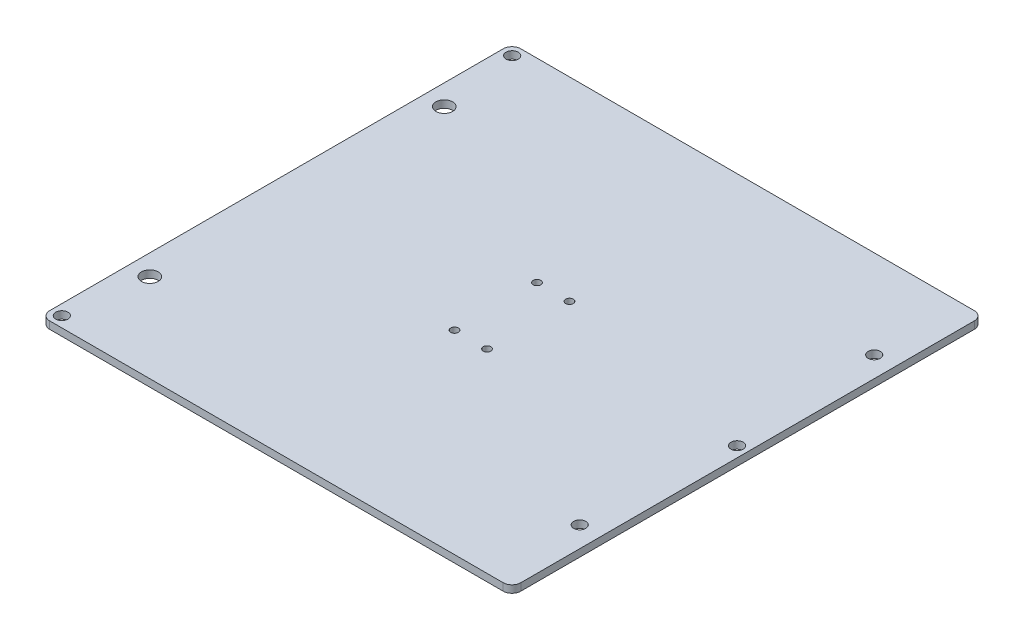
ISO-10303-21;
HEADER;
FILE_DESCRIPTION(('STEP AP214'),'2;1');
FILE_NAME('part.step','',(''),(''),'','','');
FILE_SCHEMA(('AUTOMOTIVE_DESIGN { 1 0 10303 214 1 1 1 1 }'));
ENDSEC;
DATA;
#1=APPLICATION_CONTEXT('core data for automotive mechanical design processes');
#2=APPLICATION_PROTOCOL_DEFINITION('international standard','automotive_design',2000,#1);
#3=PRODUCT_CONTEXT('',#1,'mechanical');
#4=PRODUCT('Part','Part','',(#3));
#5=PRODUCT_RELATED_PRODUCT_CATEGORY('part','',(#4));
#6=PRODUCT_DEFINITION_FORMATION('','',#4);
#7=PRODUCT_DEFINITION_CONTEXT('part definition',#1,'design');
#8=PRODUCT_DEFINITION('design','',#6,#7);
#9=PRODUCT_DEFINITION_SHAPE('','',#8);
#10=(LENGTH_UNIT() NAMED_UNIT(*) SI_UNIT(.MILLI.,.METRE.));
#11=(NAMED_UNIT(*) PLANE_ANGLE_UNIT() SI_UNIT($,.RADIAN.));
#12=(NAMED_UNIT(*) SI_UNIT($,.STERADIAN.) SOLID_ANGLE_UNIT());
#13=UNCERTAINTY_MEASURE_WITH_UNIT(LENGTH_MEASURE(1.E-05),#10,'distance_accuracy_value','');
#14=(GEOMETRIC_REPRESENTATION_CONTEXT(3) GLOBAL_UNCERTAINTY_ASSIGNED_CONTEXT((#13)) GLOBAL_UNIT_ASSIGNED_CONTEXT((#10,
#11,#12)) REPRESENTATION_CONTEXT('',''));
#15=CARTESIAN_POINT('',(0.,0.,0.));
#16=DIRECTION('',(0.,0.,1.));
#17=DIRECTION('',(1.,0.,0.));
#18=AXIS2_PLACEMENT_3D('',#15,#16,#17);
#19=CARTESIAN_POINT('',(0.,3.175,0.));
#20=DIRECTION('',(1.,0.,0.));
#21=DIRECTION('',(0.,0.,-1.));
#22=AXIS2_PLACEMENT_3D('',#19,#20,#21);
#23=PLANE('',#22);
#24=DIRECTION('',(0.,0.,1.));
#25=VECTOR('',#24,1.);
#26=CARTESIAN_POINT('',(0.,3.175,0.));
#27=LINE('',#26,#25);
#28=CARTESIAN_POINT('',(0.,3.175,-199.39));
#29=VERTEX_POINT('',#28);
#30=CARTESIAN_POINT('',(0.,3.175,-3.81));
#31=VERTEX_POINT('',#30);
#32=EDGE_CURVE('E118',#29,#31,#27,.T.);
#33=ORIENTED_EDGE('',*,*,#32,.F.);
#34=DIRECTION('',(0.,-1.,0.));
#35=VECTOR('',#34,1.);
#36=CARTESIAN_POINT('',(0.,3.175,-199.39));
#37=LINE('',#36,#35);
#38=CARTESIAN_POINT('',(0.,0.,-199.39));
#39=VERTEX_POINT('',#38);
#40=EDGE_CURVE('E103',#29,#39,#37,.T.);
#41=ORIENTED_EDGE('',*,*,#40,.T.);
#42=DIRECTION('',(0.,0.,1.));
#43=VECTOR('',#42,1.);
#44=CARTESIAN_POINT('',(0.,0.,0.));
#45=LINE('',#44,#43);
#46=CARTESIAN_POINT('',(0.,0.,-3.81));
#47=VERTEX_POINT('',#46);
#48=EDGE_CURVE('E115',#39,#47,#45,.T.);
#49=ORIENTED_EDGE('',*,*,#48,.T.);
#50=DIRECTION('',(0.,-1.,0.));
#51=VECTOR('',#50,1.);
#52=CARTESIAN_POINT('',(0.,3.175,-3.81));
#53=LINE('',#52,#51);
#54=EDGE_CURVE('E120',#47,#31,#53,.F.);
#55=ORIENTED_EDGE('',*,*,#54,.T.);
#56=EDGE_LOOP('',(#33,#41,#49,#55));
#57=FACE_BOUND('',#56,.T.);
#58=ADVANCED_FACE('F33',(#57),#23,.F.);
#59=CARTESIAN_POINT('',(0.,3.175,0.));
#60=DIRECTION('',(0.,0.,-1.));
#61=DIRECTION('',(-1.,0.,0.));
#62=AXIS2_PLACEMENT_3D('',#59,#60,#61);
#63=PLANE('',#62);
#64=DIRECTION('',(1.,0.,0.));
#65=VECTOR('',#64,1.);
#66=CARTESIAN_POINT('',(0.,0.,0.));
#67=LINE('',#66,#65);
#68=CARTESIAN_POINT('',(3.81,0.,0.));
#69=VERTEX_POINT('',#68);
#70=CARTESIAN_POINT('',(199.39,0.,0.));
#71=VERTEX_POINT('',#70);
#72=EDGE_CURVE('E124',#69,#71,#67,.T.);
#73=ORIENTED_EDGE('',*,*,#72,.T.);
#74=DIRECTION('',(0.,-1.,0.));
#75=VECTOR('',#74,1.);
#76=CARTESIAN_POINT('',(199.39,3.175,0.));
#77=LINE('',#76,#75);
#78=CARTESIAN_POINT('',(199.39,3.175,0.));
#79=VERTEX_POINT('',#78);
#80=EDGE_CURVE('E11',#71,#79,#77,.F.);
#81=ORIENTED_EDGE('',*,*,#80,.T.);
#82=DIRECTION('',(1.,0.,0.));
#83=VECTOR('',#82,1.);
#84=CARTESIAN_POINT('',(0.,3.175,0.));
#85=LINE('',#84,#83);
#86=CARTESIAN_POINT('',(3.81,3.175,0.));
#87=VERTEX_POINT('',#86);
#88=EDGE_CURVE('E164',#87,#79,#85,.T.);
#89=ORIENTED_EDGE('',*,*,#88,.F.);
#90=DIRECTION('',(0.,-1.,0.));
#91=VECTOR('',#90,1.);
#92=CARTESIAN_POINT('',(3.81,3.175,0.));
#93=LINE('',#92,#91);
#94=EDGE_CURVE('E41',#87,#69,#93,.T.);
#95=ORIENTED_EDGE('',*,*,#94,.T.);
#96=EDGE_LOOP('',(#73,#81,#89,#95));
#97=FACE_BOUND('',#96,.T.);
#98=ADVANCED_FACE('F162',(#97),#63,.F.);
#99=CARTESIAN_POINT('',(203.2,3.175,0.));
#100=DIRECTION('',(-1.,0.,0.));
#101=DIRECTION('',(0.,0.,1.));
#102=AXIS2_PLACEMENT_3D('',#99,#100,#101);
#103=PLANE('',#102);
#104=DIRECTION('',(0.,0.,-1.));
#105=VECTOR('',#104,1.);
#106=CARTESIAN_POINT('',(203.2,0.,0.));
#107=LINE('',#106,#105);
#108=CARTESIAN_POINT('',(203.2,0.,-3.81));
#109=VERTEX_POINT('',#108);
#110=CARTESIAN_POINT('',(203.2,0.,-199.39));
#111=VERTEX_POINT('',#110);
#112=EDGE_CURVE('E128',#109,#111,#107,.T.);
#113=ORIENTED_EDGE('',*,*,#112,.T.);
#114=DIRECTION('',(0.,-1.,0.));
#115=VECTOR('',#114,1.);
#116=CARTESIAN_POINT('',(203.2,3.175,-199.39));
#117=LINE('',#116,#115);
#118=CARTESIAN_POINT('',(203.2,3.175,-199.39));
#119=VERTEX_POINT('',#118);
#120=EDGE_CURVE('E48',#111,#119,#117,.F.);
#121=ORIENTED_EDGE('',*,*,#120,.T.);
#122=DIRECTION('',(0.,0.,-1.));
#123=VECTOR('',#122,1.);
#124=CARTESIAN_POINT('',(203.2,3.175,0.));
#125=LINE('',#124,#123);
#126=CARTESIAN_POINT('',(203.2,3.175,-3.81));
#127=VERTEX_POINT('',#126);
#128=EDGE_CURVE('E172',#127,#119,#125,.T.);
#129=ORIENTED_EDGE('',*,*,#128,.F.);
#130=DIRECTION('',(0.,-1.,0.));
#131=VECTOR('',#130,1.);
#132=CARTESIAN_POINT('',(203.2,3.175,-3.81));
#133=LINE('',#132,#131);
#134=EDGE_CURVE('E155',#127,#109,#133,.T.);
#135=ORIENTED_EDGE('',*,*,#134,.T.);
#136=EDGE_LOOP('',(#113,#121,#129,#135));
#137=FACE_BOUND('',#136,.T.);
#138=ADVANCED_FACE('F171',(#137),#103,.F.);
#139=CARTESIAN_POINT('',(0.,3.175,-203.2));
#140=DIRECTION('',(0.,0.,1.));
#141=DIRECTION('',(1.,0.,0.));
#142=AXIS2_PLACEMENT_3D('',#139,#140,#141);
#143=PLANE('',#142);
#144=DIRECTION('',(-1.,0.,0.));
#145=VECTOR('',#144,1.);
#146=CARTESIAN_POINT('',(0.,0.,-203.2));
#147=LINE('',#146,#145);
#148=CARTESIAN_POINT('',(199.39,0.,-203.2));
#149=VERTEX_POINT('',#148);
#150=CARTESIAN_POINT('',(3.81,0.,-203.2));
#151=VERTEX_POINT('',#150);
#152=EDGE_CURVE('E138',#149,#151,#147,.T.);
#153=ORIENTED_EDGE('',*,*,#152,.T.);
#154=DIRECTION('',(0.,-1.,0.));
#155=VECTOR('',#154,1.);
#156=CARTESIAN_POINT('',(3.81,3.175,-203.2));
#157=LINE('',#156,#155);
#158=CARTESIAN_POINT('',(3.81,3.175,-203.2));
#159=VERTEX_POINT('',#158);
#160=EDGE_CURVE('E104',#151,#159,#157,.F.);
#161=ORIENTED_EDGE('',*,*,#160,.T.);
#162=DIRECTION('',(-1.,0.,0.));
#163=VECTOR('',#162,1.);
#164=CARTESIAN_POINT('',(0.,3.175,-203.2));
#165=LINE('',#164,#163);
#166=CARTESIAN_POINT('',(199.39,3.175,-203.2));
#167=VERTEX_POINT('',#166);
#168=EDGE_CURVE('E134',#167,#159,#165,.T.);
#169=ORIENTED_EDGE('',*,*,#168,.F.);
#170=DIRECTION('',(0.,-1.,0.));
#171=VECTOR('',#170,1.);
#172=CARTESIAN_POINT('',(199.39,3.175,-203.2));
#173=LINE('',#172,#171);
#174=EDGE_CURVE('E109',#167,#149,#173,.T.);
#175=ORIENTED_EDGE('',*,*,#174,.T.);
#176=EDGE_LOOP('',(#153,#161,#169,#175));
#177=FACE_BOUND('',#176,.T.);
#178=ADVANCED_FACE('F246',(#177),#143,.F.);
#179=CARTESIAN_POINT('',(0.,3.175,0.));
#180=DIRECTION('',(0.,-1.,0.));
#181=DIRECTION('',(0.,0.,-1.));
#182=AXIS2_PLACEMENT_3D('',#179,#180,#181);
#183=PLANE('',#182);
#184=CARTESIAN_POINT('',(94.6,3.175,-83.82));
#185=DIRECTION('',(0.,1.,0.));
#186=DIRECTION('',(0.,0.,-1.));
#187=AXIS2_PLACEMENT_3D('',#184,#185,#186);
#188=CIRCLE('',#187,1.65);
#189=CARTESIAN_POINT('',(94.6,3.175,-85.47));
#190=VERTEX_POINT('',#189);
#191=EDGE_CURVE('E232',#190,#190,#188,.T.);
#192=ORIENTED_EDGE('',*,*,#191,.F.);
#193=EDGE_LOOP('',(#192));
#194=FACE_BOUND('',#193,.T.);
#195=CARTESIAN_POINT('',(108.6,3.175,-83.82));
#196=DIRECTION('',(0.,1.,0.));
#197=DIRECTION('',(0.,0.,-1.));
#198=AXIS2_PLACEMENT_3D('',#195,#196,#197);
#199=CIRCLE('',#198,1.65);
#200=CARTESIAN_POINT('',(108.6,3.175,-85.47));
#201=VERTEX_POINT('',#200);
#202=EDGE_CURVE('E226',#201,#201,#199,.T.);
#203=ORIENTED_EDGE('',*,*,#202,.F.);
#204=EDGE_LOOP('',(#203));
#205=FACE_BOUND('',#204,.T.);
#206=CARTESIAN_POINT('',(108.6,3.175,-119.38));
#207=DIRECTION('',(0.,1.,0.));
#208=DIRECTION('',(0.,0.,1.));
#209=AXIS2_PLACEMENT_3D('',#206,#207,#208);
#210=CIRCLE('',#209,1.65);
#211=CARTESIAN_POINT('',(108.6,3.175,-117.73));
#212=VERTEX_POINT('',#211);
#213=EDGE_CURVE('E220',#212,#212,#210,.T.);
#214=ORIENTED_EDGE('',*,*,#213,.F.);
#215=EDGE_LOOP('',(#214));
#216=FACE_BOUND('',#215,.T.);
#217=CARTESIAN_POINT('',(94.6,3.175,-119.38));
#218=DIRECTION('',(0.,1.,0.));
#219=DIRECTION('',(0.,0.,1.));
#220=AXIS2_PLACEMENT_3D('',#217,#218,#219);
#221=CIRCLE('',#220,1.65);
#222=CARTESIAN_POINT('',(94.6,3.175,-117.73));
#223=VERTEX_POINT('',#222);
#224=EDGE_CURVE('E216',#223,#223,#221,.T.);
#225=ORIENTED_EDGE('',*,*,#224,.F.);
#226=EDGE_LOOP('',(#225));
#227=FACE_BOUND('',#226,.T.);
#228=CARTESIAN_POINT('',(198.6499964,3.175,-101.6));
#229=DIRECTION('',(0.,-1.,0.));
#230=DIRECTION('',(0.,0.,-1.));
#231=AXIS2_PLACEMENT_3D('',#228,#229,#230);
#232=CIRCLE('',#231,2.625);
#233=CARTESIAN_POINT('',(198.6499964,3.175,-104.225));
#234=VERTEX_POINT('',#233);
#235=EDGE_CURVE('E210',#234,#234,#232,.F.);
#236=ORIENTED_EDGE('',*,*,#235,.F.);
#237=EDGE_LOOP('',(#236));
#238=FACE_BOUND('',#237,.T.);
#239=CARTESIAN_POINT('',(4.50088,3.175,-198.77278));
#240=DIRECTION('',(0.,-1.,0.));
#241=DIRECTION('',(0.,0.,-1.));
#242=AXIS2_PLACEMENT_3D('',#239,#240,#241);
#243=CIRCLE('',#242,2.625);
#244=CARTESIAN_POINT('',(4.50088,3.175,-201.39778));
#245=VERTEX_POINT('',#244);
#246=EDGE_CURVE('E204',#245,#245,#243,.F.);
#247=ORIENTED_EDGE('',*,*,#246,.F.);
#248=EDGE_LOOP('',(#247));
#249=FACE_BOUND('',#248,.T.);
#250=CARTESIAN_POINT('',(4.50088,3.175,-4.572));
#251=DIRECTION('',(0.,-1.,0.));
#252=DIRECTION('',(0.,0.,-1.));
#253=AXIS2_PLACEMENT_3D('',#250,#251,#252);
#254=CIRCLE('',#253,2.625);
#255=CARTESIAN_POINT('',(4.50088,3.175,-7.197));
#256=VERTEX_POINT('',#255);
#257=EDGE_CURVE('E196',#256,#256,#254,.F.);
#258=ORIENTED_EDGE('',*,*,#257,.F.);
#259=EDGE_LOOP('',(#258));
#260=FACE_BOUND('',#259,.T.);
#261=CARTESIAN_POINT('',(194.29857,3.175,-165.1));
#262=DIRECTION('',(0.,1.,0.));
#263=DIRECTION('',(0.,0.,-1.));
#264=AXIS2_PLACEMENT_3D('',#261,#262,#263);
#265=CIRCLE('',#264,2.625);
#266=CARTESIAN_POINT('',(194.29857,3.175,-167.725));
#267=VERTEX_POINT('',#266);
#268=EDGE_CURVE('E190',#267,#267,#265,.T.);
#269=ORIENTED_EDGE('',*,*,#268,.F.);
#270=EDGE_LOOP('',(#269));
#271=FACE_BOUND('',#270,.T.);
#272=CARTESIAN_POINT('',(194.29857,3.175,-38.1));
#273=DIRECTION('',(0.,1.,0.));
#274=DIRECTION('',(0.,0.,-1.));
#275=AXIS2_PLACEMENT_3D('',#272,#273,#274);
#276=CIRCLE('',#275,2.625);
#277=CARTESIAN_POINT('',(194.29857,3.175,-40.725));
#278=VERTEX_POINT('',#277);
#279=EDGE_CURVE('E184',#278,#278,#276,.T.);
#280=ORIENTED_EDGE('',*,*,#279,.F.);
#281=EDGE_LOOP('',(#280));
#282=FACE_BOUND('',#281,.T.);
#283=CARTESIAN_POINT('',(8.90142999999996,3.175,-165.1));
#284=DIRECTION('',(0.,1.,0.));
#285=DIRECTION('',(0.,0.,1.));
#286=AXIS2_PLACEMENT_3D('',#283,#284,#285);
#287=CIRCLE('',#286,3.59999999999999);
#288=CARTESIAN_POINT('',(8.90142999999996,3.175,-161.5));
#289=VERTEX_POINT('',#288);
#290=EDGE_CURVE('E179',#289,#289,#287,.T.);
#291=ORIENTED_EDGE('',*,*,#290,.F.);
#292=EDGE_LOOP('',(#291));
#293=FACE_BOUND('',#292,.T.);
#294=CARTESIAN_POINT('',(8.90143,3.175,-38.1));
#295=DIRECTION('',(0.,1.,0.));
#296=DIRECTION('',(0.,0.,1.));
#297=AXIS2_PLACEMENT_3D('',#294,#295,#296);
#298=CIRCLE('',#297,3.6);
#299=CARTESIAN_POINT('',(8.90143,3.175,-34.5));
#300=VERTEX_POINT('',#299);
#301=EDGE_CURVE('E125',#300,#300,#298,.T.);
#302=ORIENTED_EDGE('',*,*,#301,.F.);
#303=EDGE_LOOP('',(#302));
#304=FACE_BOUND('',#303,.T.);
#305=ORIENTED_EDGE('',*,*,#168,.T.);
#306=CARTESIAN_POINT('',(3.81,3.175,-199.39));
#307=DIRECTION('',(0.,-1.,0.));
#308=DIRECTION('',(0.,0.,-1.));
#309=AXIS2_PLACEMENT_3D('',#306,#307,#308);
#310=CIRCLE('',#309,3.81);
#311=EDGE_CURVE('E153',#159,#29,#310,.F.);
#312=ORIENTED_EDGE('',*,*,#311,.T.);
#313=ORIENTED_EDGE('',*,*,#32,.T.);
#314=CARTESIAN_POINT('',(3.81,3.175,-3.81));
#315=DIRECTION('',(0.,-1.,0.));
#316=DIRECTION('',(0.,0.,-1.));
#317=AXIS2_PLACEMENT_3D('',#314,#315,#316);
#318=CIRCLE('',#317,3.81);
#319=EDGE_CURVE('E148',#31,#87,#318,.F.);
#320=ORIENTED_EDGE('',*,*,#319,.T.);
#321=ORIENTED_EDGE('',*,*,#88,.T.);
#322=CARTESIAN_POINT('',(199.39,3.175,-3.81));
#323=DIRECTION('',(0.,-1.,0.));
#324=DIRECTION('',(0.,0.,-1.));
#325=AXIS2_PLACEMENT_3D('',#322,#323,#324);
#326=CIRCLE('',#325,3.81);
#327=EDGE_CURVE('E55',#79,#127,#326,.F.);
#328=ORIENTED_EDGE('',*,*,#327,.T.);
#329=ORIENTED_EDGE('',*,*,#128,.T.);
#330=CARTESIAN_POINT('',(199.39,3.175,-199.39));
#331=DIRECTION('',(0.,-1.,0.));
#332=DIRECTION('',(0.,0.,-1.));
#333=AXIS2_PLACEMENT_3D('',#330,#331,#332);
#334=CIRCLE('',#333,3.81);
#335=EDGE_CURVE('E151',#119,#167,#334,.F.);
#336=ORIENTED_EDGE('',*,*,#335,.T.);
#337=EDGE_LOOP('',(#305,#312,#313,#320,#321,#328,#329,#336));
#338=FACE_BOUND('',#337,.T.);
#339=ADVANCED_FACE('F243',(#194,#205,#216,#227,#238,#249,#260,#271,#282,#293,#304,#338),#183,.F.);
#340=CARTESIAN_POINT('',(0.,0.,0.));
#341=DIRECTION('',(0.,-1.,0.));
#342=DIRECTION('',(0.,0.,-1.));
#343=AXIS2_PLACEMENT_3D('',#340,#341,#342);
#344=PLANE('',#343);
#345=CARTESIAN_POINT('',(94.6,0.,-83.82));
#346=DIRECTION('',(0.,-1.,0.));
#347=DIRECTION('',(0.,0.,-1.));
#348=AXIS2_PLACEMENT_3D('',#345,#346,#347);
#349=CIRCLE('',#348,1.65);
#350=CARTESIAN_POINT('',(94.6,0.,-85.47));
#351=VERTEX_POINT('',#350);
#352=EDGE_CURVE('E235',#351,#351,#349,.F.);
#353=ORIENTED_EDGE('',*,*,#352,.T.);
#354=EDGE_LOOP('',(#353));
#355=FACE_BOUND('',#354,.T.);
#356=CARTESIAN_POINT('',(108.6,0.,-83.82));
#357=DIRECTION('',(0.,-1.,0.));
#358=DIRECTION('',(0.,0.,-1.));
#359=AXIS2_PLACEMENT_3D('',#356,#357,#358);
#360=CIRCLE('',#359,1.65);
#361=CARTESIAN_POINT('',(108.6,0.,-85.47));
#362=VERTEX_POINT('',#361);
#363=EDGE_CURVE('E229',#362,#362,#360,.F.);
#364=ORIENTED_EDGE('',*,*,#363,.T.);
#365=EDGE_LOOP('',(#364));
#366=FACE_BOUND('',#365,.T.);
#367=CARTESIAN_POINT('',(108.6,0.,-119.38));
#368=DIRECTION('',(0.,-1.,0.));
#369=DIRECTION('',(0.,0.,-1.));
#370=AXIS2_PLACEMENT_3D('',#367,#368,#369);
#371=CIRCLE('',#370,1.65);
#372=CARTESIAN_POINT('',(108.6,0.,-121.03));
#373=VERTEX_POINT('',#372);
#374=EDGE_CURVE('E223',#373,#373,#371,.F.);
#375=ORIENTED_EDGE('',*,*,#374,.T.);
#376=EDGE_LOOP('',(#375));
#377=FACE_BOUND('',#376,.T.);
#378=CARTESIAN_POINT('',(94.6,0.,-119.38));
#379=DIRECTION('',(0.,-1.,0.));
#380=DIRECTION('',(0.,0.,-1.));
#381=AXIS2_PLACEMENT_3D('',#378,#379,#380);
#382=CIRCLE('',#381,1.65);
#383=CARTESIAN_POINT('',(94.6,0.,-121.03));
#384=VERTEX_POINT('',#383);
#385=EDGE_CURVE('E217',#384,#384,#382,.F.);
#386=ORIENTED_EDGE('',*,*,#385,.T.);
#387=EDGE_LOOP('',(#386));
#388=FACE_BOUND('',#387,.T.);
#389=CARTESIAN_POINT('',(198.6499964,0.,-101.6));
#390=DIRECTION('',(0.,-1.,0.));
#391=DIRECTION('',(0.,0.,-1.));
#392=AXIS2_PLACEMENT_3D('',#389,#390,#391);
#393=CIRCLE('',#392,2.625);
#394=CARTESIAN_POINT('',(198.6499964,0.,-104.225));
#395=VERTEX_POINT('',#394);
#396=EDGE_CURVE('E213',#395,#395,#393,.T.);
#397=ORIENTED_EDGE('',*,*,#396,.F.);
#398=EDGE_LOOP('',(#397));
#399=FACE_BOUND('',#398,.T.);
#400=CARTESIAN_POINT('',(4.50088,0.,-198.77278));
#401=DIRECTION('',(0.,-1.,0.));
#402=DIRECTION('',(0.,0.,-1.));
#403=AXIS2_PLACEMENT_3D('',#400,#401,#402);
#404=CIRCLE('',#403,2.625);
#405=CARTESIAN_POINT('',(4.50088,0.,-201.39778));
#406=VERTEX_POINT('',#405);
#407=EDGE_CURVE('E207',#406,#406,#404,.T.);
#408=ORIENTED_EDGE('',*,*,#407,.F.);
#409=EDGE_LOOP('',(#408));
#410=FACE_BOUND('',#409,.T.);
#411=CARTESIAN_POINT('',(4.50088,0.,-4.572));
#412=DIRECTION('',(0.,-1.,0.));
#413=DIRECTION('',(0.,0.,-1.));
#414=AXIS2_PLACEMENT_3D('',#411,#412,#413);
#415=CIRCLE('',#414,2.625);
#416=CARTESIAN_POINT('',(4.50088,0.,-7.197));
#417=VERTEX_POINT('',#416);
#418=EDGE_CURVE('E201',#417,#417,#415,.T.);
#419=ORIENTED_EDGE('',*,*,#418,.F.);
#420=EDGE_LOOP('',(#419));
#421=FACE_BOUND('',#420,.T.);
#422=CARTESIAN_POINT('',(194.29857,0.,-165.1));
#423=DIRECTION('',(0.,-1.,0.));
#424=DIRECTION('',(0.,0.,-1.));
#425=AXIS2_PLACEMENT_3D('',#422,#423,#424);
#426=CIRCLE('',#425,2.625);
#427=CARTESIAN_POINT('',(194.29857,0.,-167.725));
#428=VERTEX_POINT('',#427);
#429=EDGE_CURVE('E193',#428,#428,#426,.F.);
#430=ORIENTED_EDGE('',*,*,#429,.T.);
#431=EDGE_LOOP('',(#430));
#432=FACE_BOUND('',#431,.T.);
#433=CARTESIAN_POINT('',(194.29857,0.,-38.1));
#434=DIRECTION('',(0.,-1.,0.));
#435=DIRECTION('',(0.,0.,-1.));
#436=AXIS2_PLACEMENT_3D('',#433,#434,#435);
#437=CIRCLE('',#436,2.625);
#438=CARTESIAN_POINT('',(194.29857,0.,-40.725));
#439=VERTEX_POINT('',#438);
#440=EDGE_CURVE('E187',#439,#439,#437,.F.);
#441=ORIENTED_EDGE('',*,*,#440,.T.);
#442=EDGE_LOOP('',(#441));
#443=FACE_BOUND('',#442,.T.);
#444=CARTESIAN_POINT('',(8.90142999999996,0.,-165.1));
#445=DIRECTION('',(0.,-1.,0.));
#446=DIRECTION('',(0.,0.,-1.));
#447=AXIS2_PLACEMENT_3D('',#444,#445,#446);
#448=CIRCLE('',#447,3.59999999999999);
#449=CARTESIAN_POINT('',(8.90142999999996,0.,-168.7));
#450=VERTEX_POINT('',#449);
#451=EDGE_CURVE('E181',#450,#450,#448,.F.);
#452=ORIENTED_EDGE('',*,*,#451,.T.);
#453=EDGE_LOOP('',(#452));
#454=FACE_BOUND('',#453,.T.);
#455=CARTESIAN_POINT('',(8.90143,0.,-38.1));
#456=DIRECTION('',(0.,-1.,0.));
#457=DIRECTION('',(0.,0.,-1.));
#458=AXIS2_PLACEMENT_3D('',#455,#456,#457);
#459=CIRCLE('',#458,3.6);
#460=CARTESIAN_POINT('',(8.90143,0.,-41.7));
#461=VERTEX_POINT('',#460);
#462=EDGE_CURVE('E131',#461,#461,#459,.F.);
#463=ORIENTED_EDGE('',*,*,#462,.T.);
#464=EDGE_LOOP('',(#463));
#465=FACE_BOUND('',#464,.T.);
#466=ORIENTED_EDGE('',*,*,#48,.F.);
#467=CARTESIAN_POINT('',(3.81,0.,-199.39));
#468=DIRECTION('',(0.,-1.,0.));
#469=DIRECTION('',(0.,0.,-1.));
#470=AXIS2_PLACEMENT_3D('',#467,#468,#469);
#471=CIRCLE('',#470,3.81);
#472=EDGE_CURVE('E99',#39,#151,#471,.T.);
#473=ORIENTED_EDGE('',*,*,#472,.T.);
#474=ORIENTED_EDGE('',*,*,#152,.F.);
#475=CARTESIAN_POINT('',(199.39,0.,-199.39));
#476=DIRECTION('',(0.,-1.,0.));
#477=DIRECTION('',(0.,0.,-1.));
#478=AXIS2_PLACEMENT_3D('',#475,#476,#477);
#479=CIRCLE('',#478,3.81);
#480=EDGE_CURVE('E110',#149,#111,#479,.T.);
#481=ORIENTED_EDGE('',*,*,#480,.T.);
#482=ORIENTED_EDGE('',*,*,#112,.F.);
#483=CARTESIAN_POINT('',(199.39,0.,-3.81));
#484=DIRECTION('',(0.,-1.,0.));
#485=DIRECTION('',(0.,0.,-1.));
#486=AXIS2_PLACEMENT_3D('',#483,#484,#485);
#487=CIRCLE('',#486,3.81);
#488=EDGE_CURVE('E142',#109,#71,#487,.T.);
#489=ORIENTED_EDGE('',*,*,#488,.T.);
#490=ORIENTED_EDGE('',*,*,#72,.F.);
#491=CARTESIAN_POINT('',(3.81,0.,-3.81));
#492=DIRECTION('',(0.,-1.,0.));
#493=DIRECTION('',(0.,0.,-1.));
#494=AXIS2_PLACEMENT_3D('',#491,#492,#493);
#495=CIRCLE('',#494,3.81);
#496=EDGE_CURVE('E119',#69,#47,#495,.T.);
#497=ORIENTED_EDGE('',*,*,#496,.T.);
#498=EDGE_LOOP('',(#466,#473,#474,#481,#482,#489,#490,#497));
#499=FACE_BOUND('',#498,.T.);
#500=ADVANCED_FACE('F122',(#355,#366,#377,#388,#399,#410,#421,#432,#443,#454,#465,#499),#344,.T.);
#501=CARTESIAN_POINT('',(8.90143,-0.00100000000000013,-38.1));
#502=DIRECTION('',(0.,1.,0.));
#503=DIRECTION('',(0.,0.,1.));
#504=AXIS2_PLACEMENT_3D('',#501,#502,#503);
#505=CYLINDRICAL_SURFACE('',#504,3.6);
#506=ORIENTED_EDGE('',*,*,#462,.F.);
#507=EDGE_LOOP('',(#506));
#508=FACE_BOUND('',#507,.T.);
#509=ORIENTED_EDGE('',*,*,#301,.T.);
#510=EDGE_LOOP('',(#509));
#511=FACE_BOUND('',#510,.T.);
#512=ADVANCED_FACE('F292',(#508,#511),#505,.F.);
#513=CARTESIAN_POINT('',(8.90142999999996,-0.00100000000000013,-165.1));
#514=DIRECTION('',(0.,1.,0.));
#515=DIRECTION('',(0.,0.,1.));
#516=AXIS2_PLACEMENT_3D('',#513,#514,#515);
#517=CYLINDRICAL_SURFACE('',#516,3.59999999999999);
#518=ORIENTED_EDGE('',*,*,#451,.F.);
#519=EDGE_LOOP('',(#518));
#520=FACE_BOUND('',#519,.T.);
#521=ORIENTED_EDGE('',*,*,#290,.T.);
#522=EDGE_LOOP('',(#521));
#523=FACE_BOUND('',#522,.T.);
#524=ADVANCED_FACE('F297',(#520,#523),#517,.F.);
#525=CARTESIAN_POINT('',(194.29857,-0.00100000000000013,-38.1));
#526=DIRECTION('',(0.,1.,0.));
#527=DIRECTION('',(0.,0.,1.));
#528=AXIS2_PLACEMENT_3D('',#525,#526,#527);
#529=CYLINDRICAL_SURFACE('',#528,2.625);
#530=ORIENTED_EDGE('',*,*,#440,.F.);
#531=EDGE_LOOP('',(#530));
#532=FACE_BOUND('',#531,.T.);
#533=ORIENTED_EDGE('',*,*,#279,.T.);
#534=EDGE_LOOP('',(#533));
#535=FACE_BOUND('',#534,.T.);
#536=ADVANCED_FACE('F301',(#532,#535),#529,.F.);
#537=CARTESIAN_POINT('',(194.29857,-0.00100000000000013,-165.1));
#538=DIRECTION('',(0.,1.,0.));
#539=DIRECTION('',(0.,0.,1.));
#540=AXIS2_PLACEMENT_3D('',#537,#538,#539);
#541=CYLINDRICAL_SURFACE('',#540,2.625);
#542=ORIENTED_EDGE('',*,*,#429,.F.);
#543=EDGE_LOOP('',(#542));
#544=FACE_BOUND('',#543,.T.);
#545=ORIENTED_EDGE('',*,*,#268,.T.);
#546=EDGE_LOOP('',(#545));
#547=FACE_BOUND('',#546,.T.);
#548=ADVANCED_FACE('F305',(#544,#547),#541,.F.);
#549=CARTESIAN_POINT('',(4.50088,3.176,-4.572));
#550=DIRECTION('',(0.,-1.,0.));
#551=DIRECTION('',(0.,0.,-1.));
#552=AXIS2_PLACEMENT_3D('',#549,#550,#551);
#553=CYLINDRICAL_SURFACE('',#552,2.625);
#554=ORIENTED_EDGE('',*,*,#418,.T.);
#555=EDGE_LOOP('',(#554));
#556=FACE_BOUND('',#555,.T.);
#557=ORIENTED_EDGE('',*,*,#257,.T.);
#558=EDGE_LOOP('',(#557));
#559=FACE_BOUND('',#558,.T.);
#560=ADVANCED_FACE('F309',(#556,#559),#553,.F.);
#561=CARTESIAN_POINT('',(4.50088,3.176,-198.77278));
#562=DIRECTION('',(0.,-1.,0.));
#563=DIRECTION('',(0.,0.,-1.));
#564=AXIS2_PLACEMENT_3D('',#561,#562,#563);
#565=CYLINDRICAL_SURFACE('',#564,2.625);
#566=ORIENTED_EDGE('',*,*,#407,.T.);
#567=EDGE_LOOP('',(#566));
#568=FACE_BOUND('',#567,.T.);
#569=ORIENTED_EDGE('',*,*,#246,.T.);
#570=EDGE_LOOP('',(#569));
#571=FACE_BOUND('',#570,.T.);
#572=ADVANCED_FACE('F313',(#568,#571),#565,.F.);
#573=CARTESIAN_POINT('',(198.6499964,3.176,-101.6));
#574=DIRECTION('',(0.,-1.,0.));
#575=DIRECTION('',(0.,0.,-1.));
#576=AXIS2_PLACEMENT_3D('',#573,#574,#575);
#577=CYLINDRICAL_SURFACE('',#576,2.625);
#578=ORIENTED_EDGE('',*,*,#396,.T.);
#579=EDGE_LOOP('',(#578));
#580=FACE_BOUND('',#579,.T.);
#581=ORIENTED_EDGE('',*,*,#235,.T.);
#582=EDGE_LOOP('',(#581));
#583=FACE_BOUND('',#582,.T.);
#584=ADVANCED_FACE('F278',(#580,#583),#577,.F.);
#585=CARTESIAN_POINT('',(3.81,3.175,-199.39));
#586=DIRECTION('',(0.,-1.,0.));
#587=DIRECTION('',(0.,0.,-1.));
#588=AXIS2_PLACEMENT_3D('',#585,#586,#587);
#589=CYLINDRICAL_SURFACE('',#588,3.81);
#590=ORIENTED_EDGE('',*,*,#311,.F.);
#591=ORIENTED_EDGE('',*,*,#160,.F.);
#592=ORIENTED_EDGE('',*,*,#472,.F.);
#593=ORIENTED_EDGE('',*,*,#40,.F.);
#594=EDGE_LOOP('',(#590,#591,#592,#593));
#595=FACE_BOUND('',#594,.T.);
#596=ADVANCED_FACE('F102',(#595),#589,.T.);
#597=CARTESIAN_POINT('',(199.39,3.175,-199.39));
#598=DIRECTION('',(0.,-1.,0.));
#599=DIRECTION('',(0.,0.,-1.));
#600=AXIS2_PLACEMENT_3D('',#597,#598,#599);
#601=CYLINDRICAL_SURFACE('',#600,3.81);
#602=ORIENTED_EDGE('',*,*,#335,.F.);
#603=ORIENTED_EDGE('',*,*,#120,.F.);
#604=ORIENTED_EDGE('',*,*,#480,.F.);
#605=ORIENTED_EDGE('',*,*,#174,.F.);
#606=EDGE_LOOP('',(#602,#603,#604,#605));
#607=FACE_BOUND('',#606,.T.);
#608=ADVANCED_FACE('F271',(#607),#601,.T.);
#609=CARTESIAN_POINT('',(199.39,3.175,-3.81));
#610=DIRECTION('',(0.,-1.,0.));
#611=DIRECTION('',(0.,0.,-1.));
#612=AXIS2_PLACEMENT_3D('',#609,#610,#611);
#613=CYLINDRICAL_SURFACE('',#612,3.81);
#614=ORIENTED_EDGE('',*,*,#327,.F.);
#615=ORIENTED_EDGE('',*,*,#80,.F.);
#616=ORIENTED_EDGE('',*,*,#488,.F.);
#617=ORIENTED_EDGE('',*,*,#134,.F.);
#618=EDGE_LOOP('',(#614,#615,#616,#617));
#619=FACE_BOUND('',#618,.T.);
#620=ADVANCED_FACE('F170',(#619),#613,.T.);
#621=CARTESIAN_POINT('',(3.81,3.175,-3.81));
#622=DIRECTION('',(0.,-1.,0.));
#623=DIRECTION('',(0.,0.,-1.));
#624=AXIS2_PLACEMENT_3D('',#621,#622,#623);
#625=CYLINDRICAL_SURFACE('',#624,3.81);
#626=ORIENTED_EDGE('',*,*,#319,.F.);
#627=ORIENTED_EDGE('',*,*,#54,.F.);
#628=ORIENTED_EDGE('',*,*,#496,.F.);
#629=ORIENTED_EDGE('',*,*,#94,.F.);
#630=EDGE_LOOP('',(#626,#627,#628,#629));
#631=FACE_BOUND('',#630,.T.);
#632=ADVANCED_FACE('F35',(#631),#625,.T.);
#633=CARTESIAN_POINT('',(94.6,-0.00100000000000013,-119.38));
#634=DIRECTION('',(0.,1.,0.));
#635=DIRECTION('',(0.,0.,1.));
#636=AXIS2_PLACEMENT_3D('',#633,#634,#635);
#637=CYLINDRICAL_SURFACE('',#636,1.65);
#638=ORIENTED_EDGE('',*,*,#385,.F.);
#639=EDGE_LOOP('',(#638));
#640=FACE_BOUND('',#639,.T.);
#641=ORIENTED_EDGE('',*,*,#224,.T.);
#642=EDGE_LOOP('',(#641));
#643=FACE_BOUND('',#642,.T.);
#644=ADVANCED_FACE('F321',(#640,#643),#637,.F.);
#645=CARTESIAN_POINT('',(108.6,-0.00100000000000013,-119.38));
#646=DIRECTION('',(0.,1.,0.));
#647=DIRECTION('',(0.,0.,1.));
#648=AXIS2_PLACEMENT_3D('',#645,#646,#647);
#649=CYLINDRICAL_SURFACE('',#648,1.65);
#650=ORIENTED_EDGE('',*,*,#374,.F.);
#651=EDGE_LOOP('',(#650));
#652=FACE_BOUND('',#651,.T.);
#653=ORIENTED_EDGE('',*,*,#213,.T.);
#654=EDGE_LOOP('',(#653));
#655=FACE_BOUND('',#654,.T.);
#656=ADVANCED_FACE('F324',(#652,#655),#649,.F.);
#657=CARTESIAN_POINT('',(108.6,-0.00100000000000013,-83.82));
#658=DIRECTION('',(0.,1.,0.));
#659=DIRECTION('',(0.,0.,1.));
#660=AXIS2_PLACEMENT_3D('',#657,#658,#659);
#661=CYLINDRICAL_SURFACE('',#660,1.65);
#662=ORIENTED_EDGE('',*,*,#363,.F.);
#663=EDGE_LOOP('',(#662));
#664=FACE_BOUND('',#663,.T.);
#665=ORIENTED_EDGE('',*,*,#202,.T.);
#666=EDGE_LOOP('',(#665));
#667=FACE_BOUND('',#666,.T.);
#668=ADVANCED_FACE('F328',(#664,#667),#661,.F.);
#669=CARTESIAN_POINT('',(94.6,-0.00100000000000013,-83.82));
#670=DIRECTION('',(0.,1.,0.));
#671=DIRECTION('',(0.,0.,1.));
#672=AXIS2_PLACEMENT_3D('',#669,#670,#671);
#673=CYLINDRICAL_SURFACE('',#672,1.65);
#674=ORIENTED_EDGE('',*,*,#352,.F.);
#675=EDGE_LOOP('',(#674));
#676=FACE_BOUND('',#675,.T.);
#677=ORIENTED_EDGE('',*,*,#191,.T.);
#678=EDGE_LOOP('',(#677));
#679=FACE_BOUND('',#678,.T.);
#680=ADVANCED_FACE('F241',(#676,#679),#673,.F.);
#681=CLOSED_SHELL('',(#58,#98,#138,#178,#339,#500,#512,#524,#536,#548,#560,#572,#584,#596,#608,
#620,#632,#644,#656,#668,#680));
#682=MANIFOLD_SOLID_BREP('B2',#681);
#683=ADVANCED_BREP_SHAPE_REPRESENTATION('',(#18,#682),#14);
#684=SHAPE_DEFINITION_REPRESENTATION(#9,#683);
ENDSEC;
END-ISO-10303-21;
